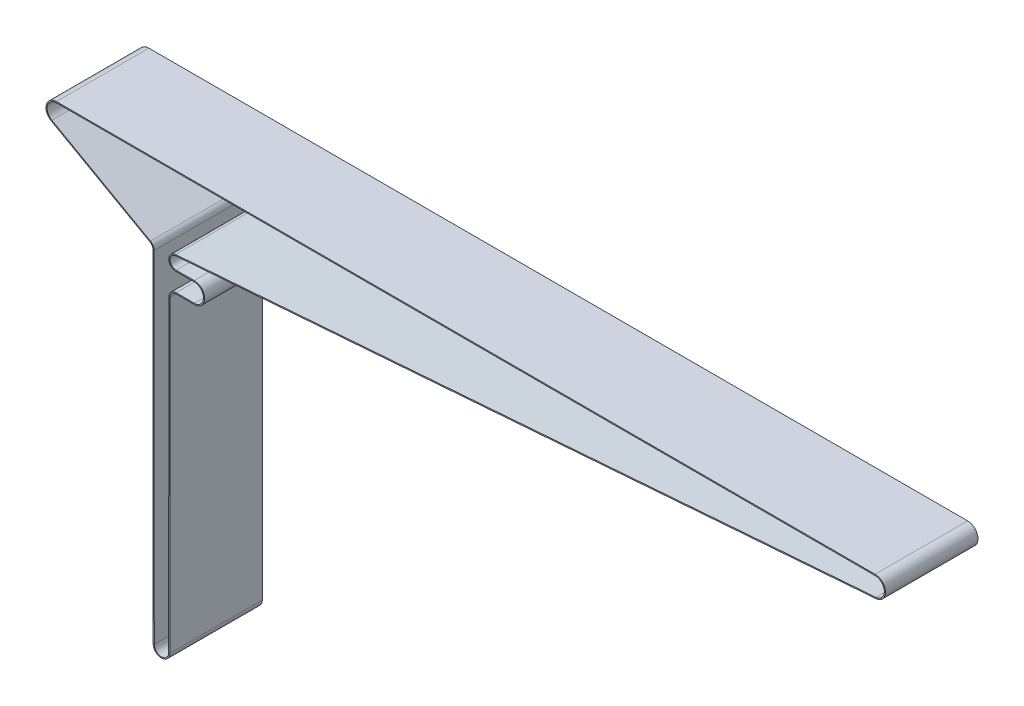
ISO-10303-21;
HEADER;
FILE_DESCRIPTION(('STEP AP214'),'2;1');
FILE_NAME('part.step','',(''),(''),'','','');
FILE_SCHEMA(('AUTOMOTIVE_DESIGN { 1 0 10303 214 1 1 1 1 }'));
ENDSEC;
DATA;
#1=APPLICATION_CONTEXT('core data for automotive mechanical design processes');
#2=APPLICATION_PROTOCOL_DEFINITION('international standard','automotive_design',2000,#1);
#3=PRODUCT_CONTEXT('',#1,'mechanical');
#4=PRODUCT('Part','Part','',(#3));
#5=PRODUCT_RELATED_PRODUCT_CATEGORY('part','',(#4));
#6=PRODUCT_DEFINITION_FORMATION('','',#4);
#7=PRODUCT_DEFINITION_CONTEXT('part definition',#1,'design');
#8=PRODUCT_DEFINITION('design','',#6,#7);
#9=PRODUCT_DEFINITION_SHAPE('','',#8);
#10=(LENGTH_UNIT() NAMED_UNIT(*) SI_UNIT(.MILLI.,.METRE.));
#11=(NAMED_UNIT(*) PLANE_ANGLE_UNIT() SI_UNIT($,.RADIAN.));
#12=(NAMED_UNIT(*) SI_UNIT($,.STERADIAN.) SOLID_ANGLE_UNIT());
#13=UNCERTAINTY_MEASURE_WITH_UNIT(LENGTH_MEASURE(1.E-05),#10,'distance_accuracy_value','');
#14=(GEOMETRIC_REPRESENTATION_CONTEXT(3) GLOBAL_UNCERTAINTY_ASSIGNED_CONTEXT((#13)) GLOBAL_UNIT_ASSIGNED_CONTEXT((#10,
#11,#12)) REPRESENTATION_CONTEXT('',''));
#15=CARTESIAN_POINT('',(0.,0.,0.));
#16=DIRECTION('',(0.,0.,1.));
#17=DIRECTION('',(1.,0.,0.));
#18=AXIS2_PLACEMENT_3D('',#15,#16,#17);
#19=CARTESIAN_POINT('',(-1124.003,0.,63.5));
#20=DIRECTION('',(0.,0.,1.));
#21=DIRECTION('',(1.,0.,0.));
#22=AXIS2_PLACEMENT_3D('',#19,#20,#21);
#23=PLANE('',#22);
#24=CARTESIAN_POINT('',(-1124.003,0.,63.5));
#25=DIRECTION('',(0.,0.,1.));
#26=DIRECTION('',(1.,0.,0.));
#27=AXIS2_PLACEMENT_3D('',#24,#25,#26);
#28=CIRCLE('',#27,14.2239999999999);
#29=CARTESIAN_POINT('',(-1124.003,14.2239999999999,63.5));
#30=VERTEX_POINT('',#29);
#31=CARTESIAN_POINT('',(-1130.96563725529,-12.403380928246,63.5));
#32=VERTEX_POINT('',#31);
#33=EDGE_CURVE('E517',#30,#32,#28,.T.);
#34=ORIENTED_EDGE('',*,*,#33,.T.);
#35=DIRECTION('',(0.872003721052174,-0.489499244607347,0.));
#36=VECTOR('',#35,1.);
#37=CARTESIAN_POINT('',(-1130.96563725529,-12.403380928246,63.5));
#38=LINE('',#37,#36);
#39=CARTESIAN_POINT('',(-995.600017331701,-88.3908648101406,63.5));
#40=VERTEX_POINT('',#39);
#41=EDGE_CURVE('E521',#32,#40,#38,.T.);
#42=ORIENTED_EDGE('',*,*,#41,.T.);
#43=CARTESIAN_POINT('',(-999.703,-95.7,63.5));
#44=DIRECTION('',(0.,0.,1.));
#45=DIRECTION('',(1.,0.,0.));
#46=AXIS2_PLACEMENT_3D('',#43,#44,#45);
#47=CIRCLE('',#46,8.3820000000001);
#48=CARTESIAN_POINT('',(-991.321000675714,-95.696634338988,63.5));
#49=VERTEX_POINT('',#48);
#50=EDGE_CURVE('E525',#49,#40,#47,.T.);
#51=ORIENTED_EDGE('',*,*,#50,.F.);
#52=DIRECTION('',(-0.000401534360747311,0.999999919385075,0.));
#53=VECTOR('',#52,1.);
#54=CARTESIAN_POINT('',(-991.132999078571,-563.904589537743,63.5));
#55=LINE('',#54,#53);
#56=CARTESIAN_POINT('',(-991.132999078571,-563.904589537743,63.5));
#57=VERTEX_POINT('',#56);
#58=EDGE_CURVE('E529',#57,#49,#55,.T.);
#59=ORIENTED_EDGE('',*,*,#58,.F.);
#60=CARTESIAN_POINT('',(-979.703,-563.9,63.5));
#61=DIRECTION('',(0.,0.,1.));
#62=DIRECTION('',(1.,0.,0.));
#63=AXIS2_PLACEMENT_3D('',#60,#61,#62);
#64=CIRCLE('',#63,11.4299999999998);
#65=CARTESIAN_POINT('',(-968.273001127799,-563.905077545945,63.5));
#66=VERTEX_POINT('',#65);
#67=EDGE_CURVE('E533',#57,#66,#64,.T.);
#68=ORIENTED_EDGE('',*,*,#67,.T.);
#69=DIRECTION('',(-0.000444229741491754,-0.999999901329964,0.));
#70=VECTOR('',#69,1.);
#71=CARTESIAN_POINT('',(-968.084999172948,-140.696276466307,63.5));
#72=LINE('',#71,#70);
#73=CARTESIAN_POINT('',(-968.084999172948,-140.696276466307,63.5));
#74=VERTEX_POINT('',#73);
#75=EDGE_CURVE('E536',#74,#66,#72,.T.);
#76=ORIENTED_EDGE('',*,*,#75,.F.);
#77=CARTESIAN_POINT('',(-959.703,-140.7,63.5));
#78=DIRECTION('',(0.,0.,1.));
#79=DIRECTION('',(1.,0.,0.));
#80=AXIS2_PLACEMENT_3D('',#77,#78,#79);
#81=CIRCLE('',#80,8.382);
#82=CARTESIAN_POINT('',(-959.66739224998,-132.318075633356,63.5));
#83=VERTEX_POINT('',#82);
#84=EDGE_CURVE('E540',#83,#74,#81,.T.);
#85=ORIENTED_EDGE('',*,*,#84,.F.);
#86=DIRECTION('',(-0.999990976693377,0.00424812097595381,0.));
#87=VECTOR('',#86,1.);
#88=CARTESIAN_POINT('',(-934.763425272762,-132.423871652486,63.5));
#89=LINE('',#88,#87);
#90=CARTESIAN_POINT('',(-934.763425272762,-132.423871652486,63.5));
#91=VERTEX_POINT('',#90);
#92=EDGE_CURVE('E543',#91,#83,#89,.T.);
#93=ORIENTED_EDGE('',*,*,#92,.F.);
#94=CARTESIAN_POINT('',(-934.703,-118.2,63.5));
#95=DIRECTION('',(0.,0.,1.));
#96=DIRECTION('',(1.,0.,0.));
#97=AXIS2_PLACEMENT_3D('',#94,#95,#96);
#98=CIRCLE('',#97,14.224);
#99=CARTESIAN_POINT('',(-934.763425272762,-103.976128347513,63.5));
#100=VERTEX_POINT('',#99);
#101=EDGE_CURVE('E547',#100,#91,#98,.F.);
#102=ORIENTED_EDGE('',*,*,#101,.F.);
#103=DIRECTION('',(0.999990976693377,0.00424812097596445,0.));
#104=VECTOR('',#103,1.);
#105=CARTESIAN_POINT('',(-959.66739224998,-104.081924366644,63.5));
#106=LINE('',#105,#104);
#107=CARTESIAN_POINT('',(-959.66739224998,-104.081924366644,63.5));
#108=VERTEX_POINT('',#107);
#109=EDGE_CURVE('E551',#108,#100,#106,.T.);
#110=ORIENTED_EDGE('',*,*,#109,.F.);
#111=CARTESIAN_POINT('',(-959.703,-95.7,63.5));
#112=DIRECTION('',(0.,0.,1.));
#113=DIRECTION('',(1.,0.,0.));
#114=AXIS2_PLACEMENT_3D('',#111,#112,#113);
#115=CIRCLE('',#114,8.382);
#116=CARTESIAN_POINT('',(-960.338990006156,-87.3421629166351,63.5));
#117=VERTEX_POINT('',#116);
#118=EDGE_CURVE('E555',#108,#117,#115,.F.);
#119=ORIENTED_EDGE('',*,*,#118,.T.);
#120=DIRECTION('',(0.997117285059044,0.0758756867282383,0.));
#121=VECTOR('',#120,1.);
#122=CARTESIAN_POINT('',(-960.338990006156,-87.3421629166351,63.5));
#123=LINE('',#122,#121);
#124=CARTESIAN_POINT('',(1.07925576802259,-14.1829962626798,63.5));
#125=VERTEX_POINT('',#124);
#126=EDGE_CURVE('E558',#117,#125,#123,.T.);
#127=ORIENTED_EDGE('',*,*,#126,.T.);
#128=CARTESIAN_POINT('',(0.,0.,63.5));
#129=DIRECTION('',(0.,0.,1.));
#130=DIRECTION('',(1.,0.,0.));
#131=AXIS2_PLACEMENT_3D('',#128,#129,#130);
#132=CIRCLE('',#131,14.224);
#133=CARTESIAN_POINT('',(-4.44089209850063E-13,14.224,63.5));
#134=VERTEX_POINT('',#133);
#135=EDGE_CURVE('E561',#125,#134,#132,.T.);
#136=ORIENTED_EDGE('',*,*,#135,.T.);
#137=DIRECTION('',(1.,0.,0.));
#138=VECTOR('',#137,1.);
#139=CARTESIAN_POINT('',(-1124.003,14.224,63.5));
#140=LINE('',#139,#138);
#141=EDGE_CURVE('E564',#30,#134,#140,.T.);
#142=ORIENTED_EDGE('',*,*,#141,.F.);
#143=EDGE_LOOP('',(#34,#42,#51,#59,#68,#76,#85,#93,#102,#110,#119,#127,#136,#142));
#144=FACE_BOUND('',#143,.T.);
#145=DIRECTION('',(0.872003721052174,-0.489499244607347,0.));
#146=VECTOR('',#145,1.);
#147=CARTESIAN_POINT('',(-1130.21964040651,-11.0744472573625,63.5));
#148=LINE('',#147,#146);
#149=CARTESIAN_POINT('',(-1130.21964040651,-11.0744472573625,63.5));
#150=VERTEX_POINT('',#149);
#151=CARTESIAN_POINT('',(-994.85402048292,-87.0619311392571,63.5));
#152=VERTEX_POINT('',#151);
#153=EDGE_CURVE('E370',#150,#152,#148,.T.);
#154=ORIENTED_EDGE('',*,*,#153,.F.);
#155=CARTESIAN_POINT('',(-1124.003,0.,63.5));
#156=DIRECTION('',(0.,0.,1.));
#157=DIRECTION('',(1.,0.,0.));
#158=AXIS2_PLACEMENT_3D('',#155,#156,#157);
#159=CIRCLE('',#158,12.6999999999999);
#160=CARTESIAN_POINT('',(-1124.003,12.7,63.5));
#161=VERTEX_POINT('',#160);
#162=EDGE_CURVE('E361',#161,#150,#159,.T.);
#163=ORIENTED_EDGE('',*,*,#162,.F.);
#164=DIRECTION('',(1.,0.,0.));
#165=VECTOR('',#164,1.);
#166=CARTESIAN_POINT('',(-1124.003,12.7,63.5));
#167=LINE('',#166,#165);
#168=CARTESIAN_POINT('',(0.,12.7,63.5));
#169=VERTEX_POINT('',#168);
#170=EDGE_CURVE('E428',#161,#169,#167,.T.);
#171=ORIENTED_EDGE('',*,*,#170,.T.);
#172=CARTESIAN_POINT('',(0.,0.,63.5));
#173=DIRECTION('',(0.,0.,1.));
#174=DIRECTION('',(1.,0.,0.));
#175=AXIS2_PLACEMENT_3D('',#172,#173,#174);
#176=CIRCLE('',#175,12.7);
#177=CARTESIAN_POINT('',(0.963621221448618,-12.6633895202498,63.5));
#178=VERTEX_POINT('',#177);
#179=EDGE_CURVE('E425',#178,#169,#176,.T.);
#180=ORIENTED_EDGE('',*,*,#179,.F.);
#181=DIRECTION('',(0.997117285059044,0.0758756867282383,0.));
#182=VECTOR('',#181,1.);
#183=CARTESIAN_POINT('',(-960.45462455273,-85.8225561742051,63.5));
#184=LINE('',#183,#182);
#185=CARTESIAN_POINT('',(-960.45462455273,-85.8225561742051,63.5));
#186=VERTEX_POINT('',#185);
#187=EDGE_CURVE('E422',#186,#178,#184,.T.);
#188=ORIENTED_EDGE('',*,*,#187,.F.);
#189=CARTESIAN_POINT('',(-959.703,-95.7,63.5));
#190=DIRECTION('',(0.,0.,-1.));
#191=DIRECTION('',(-1.,0.,0.));
#192=AXIS2_PLACEMENT_3D('',#189,#190,#191);
#193=CIRCLE('',#192,9.906);
#194=CARTESIAN_POINT('',(-959.660918113612,-105.605910615125,63.5));
#195=VERTEX_POINT('',#194);
#196=EDGE_CURVE('E419',#195,#186,#193,.T.);
#197=ORIENTED_EDGE('',*,*,#196,.F.);
#198=DIRECTION('',(0.999990976693377,0.00424812097596445,0.));
#199=VECTOR('',#198,1.);
#200=CARTESIAN_POINT('',(-959.660918113612,-105.605910615125,63.5));
#201=LINE('',#200,#199);
#202=CARTESIAN_POINT('',(-934.756951136395,-105.500114595994,63.5));
#203=VERTEX_POINT('',#202);
#204=EDGE_CURVE('E415',#195,#203,#201,.T.);
#205=ORIENTED_EDGE('',*,*,#204,.T.);
#206=CARTESIAN_POINT('',(-934.703,-118.2,63.5));
#207=DIRECTION('',(0.,0.,-1.));
#208=DIRECTION('',(-1.,0.,0.));
#209=AXIS2_PLACEMENT_3D('',#206,#207,#208);
#210=CIRCLE('',#209,12.7);
#211=CARTESIAN_POINT('',(-934.756951136395,-130.899885404006,63.5));
#212=VERTEX_POINT('',#211);
#213=EDGE_CURVE('E411',#203,#212,#210,.T.);
#214=ORIENTED_EDGE('',*,*,#213,.T.);
#215=DIRECTION('',(-0.999990976693377,0.00424812097595381,0.));
#216=VECTOR('',#215,1.);
#217=CARTESIAN_POINT('',(-934.756951136395,-130.899885404006,63.5));
#218=LINE('',#217,#216);
#219=CARTESIAN_POINT('',(-959.660918113612,-130.794089384875,63.5));
#220=VERTEX_POINT('',#219);
#221=EDGE_CURVE('E407',#212,#220,#218,.T.);
#222=ORIENTED_EDGE('',*,*,#221,.T.);
#223=CARTESIAN_POINT('',(-959.703,-140.7,63.5));
#224=DIRECTION('',(0.,0.,1.));
#225=DIRECTION('',(1.,0.,0.));
#226=AXIS2_PLACEMENT_3D('',#223,#224,#225);
#227=CIRCLE('',#226,9.906);
#228=CARTESIAN_POINT('',(-969.608999022575,-140.695599460181,63.5));
#229=VERTEX_POINT('',#228);
#230=EDGE_CURVE('E404',#220,#229,#227,.T.);
#231=ORIENTED_EDGE('',*,*,#230,.T.);
#232=DIRECTION('',(-0.000444229741491754,-0.999999901329964,0.));
#233=VECTOR('',#232,1.);
#234=CARTESIAN_POINT('',(-969.608999022575,-140.695599460181,63.5));
#235=LINE('',#234,#233);
#236=CARTESIAN_POINT('',(-969.797000977425,-563.904400539819,63.5));
#237=VERTEX_POINT('',#236);
#238=EDGE_CURVE('E400',#229,#237,#235,.T.);
#239=ORIENTED_EDGE('',*,*,#238,.T.);
#240=CARTESIAN_POINT('',(-979.703,-563.9,63.5));
#241=DIRECTION('',(0.,0.,1.));
#242=DIRECTION('',(1.,0.,0.));
#243=AXIS2_PLACEMENT_3D('',#240,#241,#242);
#244=CIRCLE('',#243,9.90599999999976);
#245=CARTESIAN_POINT('',(-989.608999201428,-563.903977599378,63.5));
#246=VERTEX_POINT('',#245);
#247=EDGE_CURVE('E397',#246,#237,#244,.T.);
#248=ORIENTED_EDGE('',*,*,#247,.F.);
#249=DIRECTION('',(-0.000401534360747311,0.999999919385075,0.));
#250=VECTOR('',#249,1.);
#251=CARTESIAN_POINT('',(-989.608999201428,-563.903977599378,63.5));
#252=LINE('',#251,#250);
#253=CARTESIAN_POINT('',(-989.797000798572,-95.6960224006224,63.5));
#254=VERTEX_POINT('',#253);
#255=EDGE_CURVE('E392',#246,#254,#252,.T.);
#256=ORIENTED_EDGE('',*,*,#255,.T.);
#257=CARTESIAN_POINT('',(-999.703,-95.7,63.5));
#258=DIRECTION('',(0.,0.,1.));
#259=DIRECTION('',(1.,0.,0.));
#260=AXIS2_PLACEMENT_3D('',#257,#258,#259);
#261=CIRCLE('',#260,9.9060000000001);
#262=EDGE_CURVE('E385',#254,#152,#261,.T.);
#263=ORIENTED_EDGE('',*,*,#262,.T.);
#264=EDGE_LOOP('',(#154,#163,#171,#180,#188,#197,#205,#214,#222,#231,#239,#248,#256,#263));
#265=FACE_BOUND('',#264,.T.);
#266=ADVANCED_FACE('F129',(#144,#265),#23,.T.);
#267=CARTESIAN_POINT('',(-1124.003,0.,-63.5));
#268=DIRECTION('',(0.,0.,1.));
#269=DIRECTION('',(1.,0.,0.));
#270=AXIS2_PLACEMENT_3D('',#267,#268,#269);
#271=PLANE('',#270);
#272=CARTESIAN_POINT('',(-1124.003,0.,-63.5));
#273=DIRECTION('',(0.,0.,1.));
#274=DIRECTION('',(1.,0.,0.));
#275=AXIS2_PLACEMENT_3D('',#272,#273,#274);
#276=CIRCLE('',#275,14.2239999999999);
#277=CARTESIAN_POINT('',(-1124.003,14.2239999999999,-63.5));
#278=VERTEX_POINT('',#277);
#279=CARTESIAN_POINT('',(-1130.96563725529,-12.403380928246,-63.5));
#280=VERTEX_POINT('',#279);
#281=EDGE_CURVE('E379',#278,#280,#276,.T.);
#282=ORIENTED_EDGE('',*,*,#281,.F.);
#283=DIRECTION('',(1.,0.,0.));
#284=VECTOR('',#283,1.);
#285=CARTESIAN_POINT('',(-1124.003,14.224,-63.5));
#286=LINE('',#285,#284);
#287=CARTESIAN_POINT('',(-4.44089209850063E-13,14.224,-63.5));
#288=VERTEX_POINT('',#287);
#289=EDGE_CURVE('E522',#278,#288,#286,.T.);
#290=ORIENTED_EDGE('',*,*,#289,.T.);
#291=CARTESIAN_POINT('',(0.,0.,-63.5));
#292=DIRECTION('',(0.,0.,1.));
#293=DIRECTION('',(1.,0.,0.));
#294=AXIS2_PLACEMENT_3D('',#291,#292,#293);
#295=CIRCLE('',#294,14.224);
#296=CARTESIAN_POINT('',(1.07925576802259,-14.1829962626798,-63.5));
#297=VERTEX_POINT('',#296);
#298=EDGE_CURVE('E614',#297,#288,#295,.T.);
#299=ORIENTED_EDGE('',*,*,#298,.F.);
#300=DIRECTION('',(0.997117285059044,0.0758756867282383,0.));
#301=VECTOR('',#300,1.);
#302=CARTESIAN_POINT('',(-960.338990006156,-87.3421629166351,-63.5));
#303=LINE('',#302,#301);
#304=CARTESIAN_POINT('',(-960.338990006156,-87.3421629166351,-63.5));
#305=VERTEX_POINT('',#304);
#306=EDGE_CURVE('E611',#305,#297,#303,.T.);
#307=ORIENTED_EDGE('',*,*,#306,.F.);
#308=CARTESIAN_POINT('',(-959.703,-95.7,-63.5));
#309=DIRECTION('',(0.,0.,1.));
#310=DIRECTION('',(1.,0.,0.));
#311=AXIS2_PLACEMENT_3D('',#308,#309,#310);
#312=CIRCLE('',#311,8.382);
#313=CARTESIAN_POINT('',(-959.66739224998,-104.081924366644,-63.5));
#314=VERTEX_POINT('',#313);
#315=EDGE_CURVE('E608',#314,#305,#312,.F.);
#316=ORIENTED_EDGE('',*,*,#315,.F.);
#317=DIRECTION('',(0.999990976693377,0.00424812097596445,0.));
#318=VECTOR('',#317,1.);
#319=CARTESIAN_POINT('',(-959.66739224998,-104.081924366644,-63.5));
#320=LINE('',#319,#318);
#321=CARTESIAN_POINT('',(-934.763425272762,-103.976128347513,-63.5));
#322=VERTEX_POINT('',#321);
#323=EDGE_CURVE('E604',#314,#322,#320,.T.);
#324=ORIENTED_EDGE('',*,*,#323,.T.);
#325=CARTESIAN_POINT('',(-934.703,-118.2,-63.5));
#326=DIRECTION('',(0.,0.,1.));
#327=DIRECTION('',(1.,0.,0.));
#328=AXIS2_PLACEMENT_3D('',#325,#326,#327);
#329=CIRCLE('',#328,14.224);
#330=CARTESIAN_POINT('',(-934.763425272762,-132.423871652486,-63.5));
#331=VERTEX_POINT('',#330);
#332=EDGE_CURVE('E600',#322,#331,#329,.F.);
#333=ORIENTED_EDGE('',*,*,#332,.T.);
#334=DIRECTION('',(-0.999990976693377,0.00424812097595381,0.));
#335=VECTOR('',#334,1.);
#336=CARTESIAN_POINT('',(-934.763425272762,-132.423871652486,-63.5));
#337=LINE('',#336,#335);
#338=CARTESIAN_POINT('',(-959.66739224998,-132.318075633356,-63.5));
#339=VERTEX_POINT('',#338);
#340=EDGE_CURVE('E596',#331,#339,#337,.T.);
#341=ORIENTED_EDGE('',*,*,#340,.T.);
#342=CARTESIAN_POINT('',(-959.703,-140.7,-63.5));
#343=DIRECTION('',(0.,0.,1.));
#344=DIRECTION('',(1.,0.,0.));
#345=AXIS2_PLACEMENT_3D('',#342,#343,#344);
#346=CIRCLE('',#345,8.382);
#347=CARTESIAN_POINT('',(-968.084999172948,-140.696276466307,-63.5));
#348=VERTEX_POINT('',#347);
#349=EDGE_CURVE('E592',#339,#348,#346,.T.);
#350=ORIENTED_EDGE('',*,*,#349,.T.);
#351=DIRECTION('',(-0.000444229741491754,-0.999999901329964,0.));
#352=VECTOR('',#351,1.);
#353=CARTESIAN_POINT('',(-968.084999172948,-140.696276466307,-63.5));
#354=LINE('',#353,#352);
#355=CARTESIAN_POINT('',(-968.273001127799,-563.905077545945,-63.5));
#356=VERTEX_POINT('',#355);
#357=EDGE_CURVE('E588',#348,#356,#354,.T.);
#358=ORIENTED_EDGE('',*,*,#357,.T.);
#359=CARTESIAN_POINT('',(-979.703,-563.9,-63.5));
#360=DIRECTION('',(0.,0.,1.));
#361=DIRECTION('',(1.,0.,0.));
#362=AXIS2_PLACEMENT_3D('',#359,#360,#361);
#363=CIRCLE('',#362,11.4299999999998);
#364=CARTESIAN_POINT('',(-991.132999078571,-563.904589537743,-63.5));
#365=VERTEX_POINT('',#364);
#366=EDGE_CURVE('E584',#365,#356,#363,.T.);
#367=ORIENTED_EDGE('',*,*,#366,.F.);
#368=DIRECTION('',(-0.000401534360747311,0.999999919385075,0.));
#369=VECTOR('',#368,1.);
#370=CARTESIAN_POINT('',(-991.132999078571,-563.904589537743,-63.5));
#371=LINE('',#370,#369);
#372=CARTESIAN_POINT('',(-991.321000675714,-95.696634338988,-63.5));
#373=VERTEX_POINT('',#372);
#374=EDGE_CURVE('E580',#365,#373,#371,.T.);
#375=ORIENTED_EDGE('',*,*,#374,.T.);
#376=CARTESIAN_POINT('',(-999.703,-95.7,-63.5));
#377=DIRECTION('',(0.,0.,1.));
#378=DIRECTION('',(1.,0.,0.));
#379=AXIS2_PLACEMENT_3D('',#376,#377,#378);
#380=CIRCLE('',#379,8.3820000000001);
#381=CARTESIAN_POINT('',(-995.600017331701,-88.3908648101406,-63.5));
#382=VERTEX_POINT('',#381);
#383=EDGE_CURVE('E576',#373,#382,#380,.T.);
#384=ORIENTED_EDGE('',*,*,#383,.T.);
#385=DIRECTION('',(0.872003721052174,-0.489499244607347,0.));
#386=VECTOR('',#385,1.);
#387=CARTESIAN_POINT('',(-1130.96563725529,-12.403380928246,-63.5));
#388=LINE('',#387,#386);
#389=EDGE_CURVE('E572',#280,#382,#388,.T.);
#390=ORIENTED_EDGE('',*,*,#389,.F.);
#391=EDGE_LOOP('',(#282,#290,#299,#307,#316,#324,#333,#341,#350,#358,#367,#375,#384,#390));
#392=FACE_BOUND('',#391,.T.);
#393=CARTESIAN_POINT('',(-1124.003,0.,-63.5));
#394=DIRECTION('',(0.,0.,1.));
#395=DIRECTION('',(1.,0.,0.));
#396=AXIS2_PLACEMENT_3D('',#393,#394,#395);
#397=CIRCLE('',#396,12.6999999999999);
#398=CARTESIAN_POINT('',(-1124.003,12.7,-63.5));
#399=VERTEX_POINT('',#398);
#400=CARTESIAN_POINT('',(-1130.21964040651,-11.0744472573625,-63.5));
#401=VERTEX_POINT('',#400);
#402=EDGE_CURVE('E156',#399,#401,#397,.T.);
#403=ORIENTED_EDGE('',*,*,#402,.T.);
#404=DIRECTION('',(0.872003721052174,-0.489499244607347,0.));
#405=VECTOR('',#404,1.);
#406=CARTESIAN_POINT('',(-1130.21964040651,-11.0744472573625,-63.5));
#407=LINE('',#406,#405);
#408=CARTESIAN_POINT('',(-994.85402048292,-87.0619311392571,-63.5));
#409=VERTEX_POINT('',#408);
#410=EDGE_CURVE('E377',#401,#409,#407,.T.);
#411=ORIENTED_EDGE('',*,*,#410,.T.);
#412=CARTESIAN_POINT('',(-999.703,-95.7,-63.5));
#413=DIRECTION('',(0.,0.,1.));
#414=DIRECTION('',(1.,0.,0.));
#415=AXIS2_PLACEMENT_3D('',#412,#413,#414);
#416=CIRCLE('',#415,9.9060000000001);
#417=CARTESIAN_POINT('',(-989.797000798572,-95.6960224006224,-63.5));
#418=VERTEX_POINT('',#417);
#419=EDGE_CURVE('E435',#418,#409,#416,.T.);
#420=ORIENTED_EDGE('',*,*,#419,.F.);
#421=DIRECTION('',(-0.000401534360747311,0.999999919385075,0.));
#422=VECTOR('',#421,1.);
#423=CARTESIAN_POINT('',(-989.608999201428,-563.903977599378,-63.5));
#424=LINE('',#423,#422);
#425=CARTESIAN_POINT('',(-989.608999201428,-563.903977599378,-63.5));
#426=VERTEX_POINT('',#425);
#427=EDGE_CURVE('E439',#426,#418,#424,.T.);
#428=ORIENTED_EDGE('',*,*,#427,.F.);
#429=CARTESIAN_POINT('',(-979.703,-563.9,-63.5));
#430=DIRECTION('',(0.,0.,1.));
#431=DIRECTION('',(1.,0.,0.));
#432=AXIS2_PLACEMENT_3D('',#429,#430,#431);
#433=CIRCLE('',#432,9.90599999999976);
#434=CARTESIAN_POINT('',(-969.797000977425,-563.904400539819,-63.5));
#435=VERTEX_POINT('',#434);
#436=EDGE_CURVE('E443',#426,#435,#433,.T.);
#437=ORIENTED_EDGE('',*,*,#436,.T.);
#438=DIRECTION('',(-0.000444229741491754,-0.999999901329964,0.));
#439=VECTOR('',#438,1.);
#440=CARTESIAN_POINT('',(-969.608999022575,-140.695599460181,-63.5));
#441=LINE('',#440,#439);
#442=CARTESIAN_POINT('',(-969.608999022575,-140.695599460181,-63.5));
#443=VERTEX_POINT('',#442);
#444=EDGE_CURVE('E447',#443,#435,#441,.T.);
#445=ORIENTED_EDGE('',*,*,#444,.F.);
#446=CARTESIAN_POINT('',(-959.703,-140.7,-63.5));
#447=DIRECTION('',(0.,0.,1.));
#448=DIRECTION('',(1.,0.,0.));
#449=AXIS2_PLACEMENT_3D('',#446,#447,#448);
#450=CIRCLE('',#449,9.906);
#451=CARTESIAN_POINT('',(-959.660918113612,-130.794089384875,-63.5));
#452=VERTEX_POINT('',#451);
#453=EDGE_CURVE('E451',#452,#443,#450,.T.);
#454=ORIENTED_EDGE('',*,*,#453,.F.);
#455=DIRECTION('',(-0.999990976693377,0.00424812097595381,0.));
#456=VECTOR('',#455,1.);
#457=CARTESIAN_POINT('',(-934.756951136395,-130.899885404006,-63.5));
#458=LINE('',#457,#456);
#459=CARTESIAN_POINT('',(-934.756951136395,-130.899885404006,-63.5));
#460=VERTEX_POINT('',#459);
#461=EDGE_CURVE('E455',#460,#452,#458,.T.);
#462=ORIENTED_EDGE('',*,*,#461,.F.);
#463=CARTESIAN_POINT('',(-934.703,-118.2,-63.5));
#464=DIRECTION('',(0.,0.,-1.));
#465=DIRECTION('',(-1.,0.,0.));
#466=AXIS2_PLACEMENT_3D('',#463,#464,#465);
#467=CIRCLE('',#466,12.7);
#468=CARTESIAN_POINT('',(-934.756951136395,-105.500114595994,-63.5));
#469=VERTEX_POINT('',#468);
#470=EDGE_CURVE('E459',#469,#460,#467,.T.);
#471=ORIENTED_EDGE('',*,*,#470,.F.);
#472=DIRECTION('',(0.999990976693377,0.00424812097596445,0.));
#473=VECTOR('',#472,1.);
#474=CARTESIAN_POINT('',(-959.660918113612,-105.605910615125,-63.5));
#475=LINE('',#474,#473);
#476=CARTESIAN_POINT('',(-959.660918113612,-105.605910615125,-63.5));
#477=VERTEX_POINT('',#476);
#478=EDGE_CURVE('E463',#477,#469,#475,.T.);
#479=ORIENTED_EDGE('',*,*,#478,.F.);
#480=CARTESIAN_POINT('',(-959.703,-95.7,-63.5));
#481=DIRECTION('',(0.,0.,-1.));
#482=DIRECTION('',(-1.,0.,0.));
#483=AXIS2_PLACEMENT_3D('',#480,#481,#482);
#484=CIRCLE('',#483,9.906);
#485=CARTESIAN_POINT('',(-960.45462455273,-85.8225561742051,-63.5));
#486=VERTEX_POINT('',#485);
#487=EDGE_CURVE('E467',#477,#486,#484,.T.);
#488=ORIENTED_EDGE('',*,*,#487,.T.);
#489=DIRECTION('',(0.997117285059044,0.0758756867282383,0.));
#490=VECTOR('',#489,1.);
#491=CARTESIAN_POINT('',(-960.45462455273,-85.8225561742051,-63.5));
#492=LINE('',#491,#490);
#493=CARTESIAN_POINT('',(0.963621221448618,-12.6633895202498,-63.5));
#494=VERTEX_POINT('',#493);
#495=EDGE_CURVE('E471',#486,#494,#492,.T.);
#496=ORIENTED_EDGE('',*,*,#495,.T.);
#497=CARTESIAN_POINT('',(0.,0.,-63.5));
#498=DIRECTION('',(0.,0.,1.));
#499=DIRECTION('',(1.,0.,0.));
#500=AXIS2_PLACEMENT_3D('',#497,#498,#499);
#501=CIRCLE('',#500,12.7);
#502=CARTESIAN_POINT('',(0.,12.7,-63.5));
#503=VERTEX_POINT('',#502);
#504=EDGE_CURVE('E475',#494,#503,#501,.T.);
#505=ORIENTED_EDGE('',*,*,#504,.T.);
#506=DIRECTION('',(1.,0.,0.));
#507=VECTOR('',#506,1.);
#508=CARTESIAN_POINT('',(-1124.003,12.7,-63.5));
#509=LINE('',#508,#507);
#510=EDGE_CURVE('E371',#399,#503,#509,.T.);
#511=ORIENTED_EDGE('',*,*,#510,.F.);
#512=EDGE_LOOP('',(#403,#411,#420,#428,#437,#445,#454,#462,#471,#479,#488,#496,#505,#511));
#513=FACE_BOUND('',#512,.T.);
#514=ADVANCED_FACE('F671',(#392,#513),#271,.F.);
#515=CARTESIAN_POINT('',(-1124.003,0.,63.5));
#516=DIRECTION('',(0.,0.,-1.));
#517=DIRECTION('',(-1.,0.,0.));
#518=AXIS2_PLACEMENT_3D('',#515,#516,#517);
#519=CYLINDRICAL_SURFACE('',#518,14.2239999999999);
#520=ORIENTED_EDGE('',*,*,#281,.T.);
#521=DIRECTION('',(0.,0.,-1.));
#522=VECTOR('',#521,1.);
#523=CARTESIAN_POINT('',(-1130.96563725529,-12.403380928246,63.5));
#524=LINE('',#523,#522);
#525=EDGE_CURVE('E12',#32,#280,#524,.T.);
#526=ORIENTED_EDGE('',*,*,#525,.F.);
#527=ORIENTED_EDGE('',*,*,#33,.F.);
#528=DIRECTION('',(0.,0.,-1.));
#529=VECTOR('',#528,1.);
#530=CARTESIAN_POINT('',(-1124.003,14.2239999999999,63.5));
#531=LINE('',#530,#529);
#532=EDGE_CURVE('E568',#30,#278,#531,.T.);
#533=ORIENTED_EDGE('',*,*,#532,.T.);
#534=EDGE_LOOP('',(#520,#526,#527,#533));
#535=FACE_BOUND('',#534,.T.);
#536=ADVANCED_FACE('F131',(#535),#519,.T.);
#537=CARTESIAN_POINT('',(-1130.96563725529,-12.403380928246,63.5));
#538=DIRECTION('',(0.489499244607347,0.872003721052174,0.));
#539=DIRECTION('',(-0.872003721052174,0.489499244607347,0.));
#540=AXIS2_PLACEMENT_3D('',#537,#538,#539);
#541=PLANE('',#540);
#542=ORIENTED_EDGE('',*,*,#389,.T.);
#543=DIRECTION('',(0.,0.,-1.));
#544=VECTOR('',#543,1.);
#545=CARTESIAN_POINT('',(-995.600017331701,-88.3908648101406,63.5));
#546=LINE('',#545,#544);
#547=EDGE_CURVE('E138',#40,#382,#546,.T.);
#548=ORIENTED_EDGE('',*,*,#547,.F.);
#549=ORIENTED_EDGE('',*,*,#41,.F.);
#550=ORIENTED_EDGE('',*,*,#525,.T.);
#551=EDGE_LOOP('',(#542,#548,#549,#550));
#552=FACE_BOUND('',#551,.T.);
#553=ADVANCED_FACE('F667',(#552),#541,.F.);
#554=CARTESIAN_POINT('',(-999.703,-95.7,63.5));
#555=DIRECTION('',(0.,0.,-1.));
#556=DIRECTION('',(-1.,0.,0.));
#557=AXIS2_PLACEMENT_3D('',#554,#555,#556);
#558=CYLINDRICAL_SURFACE('',#557,8.3820000000001);
#559=ORIENTED_EDGE('',*,*,#383,.F.);
#560=DIRECTION('',(0.,0.,-1.));
#561=VECTOR('',#560,1.);
#562=CARTESIAN_POINT('',(-991.321000675714,-95.696634338988,63.5));
#563=LINE('',#562,#561);
#564=EDGE_CURVE('E655',#49,#373,#563,.T.);
#565=ORIENTED_EDGE('',*,*,#564,.F.);
#566=ORIENTED_EDGE('',*,*,#50,.T.);
#567=ORIENTED_EDGE('',*,*,#547,.T.);
#568=EDGE_LOOP('',(#559,#565,#566,#567));
#569=FACE_BOUND('',#568,.T.);
#570=ADVANCED_FACE('F664',(#569),#558,.F.);
#571=CARTESIAN_POINT('',(-991.132999078571,-563.904589537743,63.5));
#572=DIRECTION('',(-0.999999919385075,-0.000401534360747311,0.));
#573=DIRECTION('',(0.000401534360747311,-0.999999919385075,0.));
#574=AXIS2_PLACEMENT_3D('',#571,#572,#573);
#575=PLANE('',#574);
#576=ORIENTED_EDGE('',*,*,#374,.F.);
#577=DIRECTION('',(0.,0.,-1.));
#578=VECTOR('',#577,1.);
#579=CARTESIAN_POINT('',(-991.132999078571,-563.904589537743,63.5));
#580=LINE('',#579,#578);
#581=EDGE_CURVE('E652',#57,#365,#580,.T.);
#582=ORIENTED_EDGE('',*,*,#581,.F.);
#583=ORIENTED_EDGE('',*,*,#58,.T.);
#584=ORIENTED_EDGE('',*,*,#564,.T.);
#585=EDGE_LOOP('',(#576,#582,#583,#584));
#586=FACE_BOUND('',#585,.T.);
#587=ADVANCED_FACE('F676',(#586),#575,.T.);
#588=CARTESIAN_POINT('',(-979.703,-563.9,63.5));
#589=DIRECTION('',(0.,0.,-1.));
#590=DIRECTION('',(-1.,0.,0.));
#591=AXIS2_PLACEMENT_3D('',#588,#589,#590);
#592=CYLINDRICAL_SURFACE('',#591,11.4299999999998);
#593=ORIENTED_EDGE('',*,*,#366,.T.);
#594=DIRECTION('',(0.,0.,-1.));
#595=VECTOR('',#594,1.);
#596=CARTESIAN_POINT('',(-968.273001127799,-563.905077545945,63.5));
#597=LINE('',#596,#595);
#598=EDGE_CURVE('E649',#66,#356,#597,.T.);
#599=ORIENTED_EDGE('',*,*,#598,.F.);
#600=ORIENTED_EDGE('',*,*,#67,.F.);
#601=ORIENTED_EDGE('',*,*,#581,.T.);
#602=EDGE_LOOP('',(#593,#599,#600,#601));
#603=FACE_BOUND('',#602,.T.);
#604=ADVANCED_FACE('F723',(#603),#592,.T.);
#605=CARTESIAN_POINT('',(-968.084999172948,-140.696276466307,63.5));
#606=DIRECTION('',(0.999999901329964,-0.000444229741491754,0.));
#607=DIRECTION('',(0.000444229741491754,0.999999901329964,0.));
#608=AXIS2_PLACEMENT_3D('',#605,#606,#607);
#609=PLANE('',#608);
#610=ORIENTED_EDGE('',*,*,#357,.F.);
#611=DIRECTION('',(0.,0.,-1.));
#612=VECTOR('',#611,1.);
#613=CARTESIAN_POINT('',(-968.084999172948,-140.696276466307,63.5));
#614=LINE('',#613,#612);
#615=EDGE_CURVE('E646',#74,#348,#614,.T.);
#616=ORIENTED_EDGE('',*,*,#615,.F.);
#617=ORIENTED_EDGE('',*,*,#75,.T.);
#618=ORIENTED_EDGE('',*,*,#598,.T.);
#619=EDGE_LOOP('',(#610,#616,#617,#618));
#620=FACE_BOUND('',#619,.T.);
#621=ADVANCED_FACE('F719',(#620),#609,.T.);
#622=CARTESIAN_POINT('',(-959.703,-140.7,63.5));
#623=DIRECTION('',(0.,0.,-1.));
#624=DIRECTION('',(-1.,0.,0.));
#625=AXIS2_PLACEMENT_3D('',#622,#623,#624);
#626=CYLINDRICAL_SURFACE('',#625,8.382);
#627=ORIENTED_EDGE('',*,*,#349,.F.);
#628=DIRECTION('',(0.,0.,-1.));
#629=VECTOR('',#628,1.);
#630=CARTESIAN_POINT('',(-959.66739224998,-132.318075633356,63.5));
#631=LINE('',#630,#629);
#632=EDGE_CURVE('E643',#83,#339,#631,.T.);
#633=ORIENTED_EDGE('',*,*,#632,.F.);
#634=ORIENTED_EDGE('',*,*,#84,.T.);
#635=ORIENTED_EDGE('',*,*,#615,.T.);
#636=EDGE_LOOP('',(#627,#633,#634,#635));
#637=FACE_BOUND('',#636,.T.);
#638=ADVANCED_FACE('F716',(#637),#626,.F.);
#639=CARTESIAN_POINT('',(-934.763425272762,-132.423871652486,63.5));
#640=DIRECTION('',(-0.00424812097595381,-0.999990976693377,0.));
#641=DIRECTION('',(0.999990976693377,-0.00424812097595381,0.));
#642=AXIS2_PLACEMENT_3D('',#639,#640,#641);
#643=PLANE('',#642);
#644=ORIENTED_EDGE('',*,*,#340,.F.);
#645=DIRECTION('',(0.,0.,-1.));
#646=VECTOR('',#645,1.);
#647=CARTESIAN_POINT('',(-934.763425272762,-132.423871652486,63.5));
#648=LINE('',#647,#646);
#649=EDGE_CURVE('E640',#91,#331,#648,.T.);
#650=ORIENTED_EDGE('',*,*,#649,.F.);
#651=ORIENTED_EDGE('',*,*,#92,.T.);
#652=ORIENTED_EDGE('',*,*,#632,.T.);
#653=EDGE_LOOP('',(#644,#650,#651,#652));
#654=FACE_BOUND('',#653,.T.);
#655=ADVANCED_FACE('F712',(#654),#643,.T.);
#656=CARTESIAN_POINT('',(-934.703,-118.2,63.5));
#657=DIRECTION('',(0.,0.,-1.));
#658=DIRECTION('',(-1.,0.,0.));
#659=AXIS2_PLACEMENT_3D('',#656,#657,#658);
#660=CYLINDRICAL_SURFACE('',#659,14.224);
#661=ORIENTED_EDGE('',*,*,#332,.F.);
#662=DIRECTION('',(0.,0.,-1.));
#663=VECTOR('',#662,1.);
#664=CARTESIAN_POINT('',(-934.763425272762,-103.976128347513,63.5));
#665=LINE('',#664,#663);
#666=EDGE_CURVE('E637',#100,#322,#665,.T.);
#667=ORIENTED_EDGE('',*,*,#666,.F.);
#668=ORIENTED_EDGE('',*,*,#101,.T.);
#669=ORIENTED_EDGE('',*,*,#649,.T.);
#670=EDGE_LOOP('',(#661,#667,#668,#669));
#671=FACE_BOUND('',#670,.T.);
#672=ADVANCED_FACE('F708',(#671),#660,.T.);
#673=CARTESIAN_POINT('',(-959.66739224998,-104.081924366644,63.5));
#674=DIRECTION('',(-0.00424812097596445,0.999990976693377,0.));
#675=DIRECTION('',(-0.999990976693377,-0.00424812097596445,0.));
#676=AXIS2_PLACEMENT_3D('',#673,#674,#675);
#677=PLANE('',#676);
#678=ORIENTED_EDGE('',*,*,#323,.F.);
#679=DIRECTION('',(0.,0.,-1.));
#680=VECTOR('',#679,1.);
#681=CARTESIAN_POINT('',(-959.66739224998,-104.081924366644,63.5));
#682=LINE('',#681,#680);
#683=EDGE_CURVE('E634',#108,#314,#682,.T.);
#684=ORIENTED_EDGE('',*,*,#683,.F.);
#685=ORIENTED_EDGE('',*,*,#109,.T.);
#686=ORIENTED_EDGE('',*,*,#666,.T.);
#687=EDGE_LOOP('',(#678,#684,#685,#686));
#688=FACE_BOUND('',#687,.T.);
#689=ADVANCED_FACE('F704',(#688),#677,.T.);
#690=CARTESIAN_POINT('',(-959.703,-95.7,63.5));
#691=DIRECTION('',(0.,0.,-1.));
#692=DIRECTION('',(-1.,0.,0.));
#693=AXIS2_PLACEMENT_3D('',#690,#691,#692);
#694=CYLINDRICAL_SURFACE('',#693,8.382);
#695=ORIENTED_EDGE('',*,*,#315,.T.);
#696=DIRECTION('',(0.,0.,-1.));
#697=VECTOR('',#696,1.);
#698=CARTESIAN_POINT('',(-960.338990006156,-87.3421629166351,63.5));
#699=LINE('',#698,#697);
#700=EDGE_CURVE('E630',#117,#305,#699,.T.);
#701=ORIENTED_EDGE('',*,*,#700,.F.);
#702=ORIENTED_EDGE('',*,*,#118,.F.);
#703=ORIENTED_EDGE('',*,*,#683,.T.);
#704=EDGE_LOOP('',(#695,#701,#702,#703));
#705=FACE_BOUND('',#704,.T.);
#706=ADVANCED_FACE('F701',(#705),#694,.F.);
#707=CARTESIAN_POINT('',(-960.338990006156,-87.3421629166351,63.5));
#708=DIRECTION('',(-0.0758756867282383,0.997117285059044,0.));
#709=DIRECTION('',(-0.997117285059044,-0.0758756867282383,0.));
#710=AXIS2_PLACEMENT_3D('',#707,#708,#709);
#711=PLANE('',#710);
#712=ORIENTED_EDGE('',*,*,#306,.T.);
#713=DIRECTION('',(0.,0.,-1.));
#714=VECTOR('',#713,1.);
#715=CARTESIAN_POINT('',(1.07925576802259,-14.1829962626798,63.5));
#716=LINE('',#715,#714);
#717=EDGE_CURVE('E626',#125,#297,#716,.T.);
#718=ORIENTED_EDGE('',*,*,#717,.F.);
#719=ORIENTED_EDGE('',*,*,#126,.F.);
#720=ORIENTED_EDGE('',*,*,#700,.T.);
#721=EDGE_LOOP('',(#712,#718,#719,#720));
#722=FACE_BOUND('',#721,.T.);
#723=ADVANCED_FACE('F696',(#722),#711,.F.);
#724=CARTESIAN_POINT('',(0.,0.,63.5));
#725=DIRECTION('',(0.,0.,-1.));
#726=DIRECTION('',(-1.,0.,0.));
#727=AXIS2_PLACEMENT_3D('',#724,#725,#726);
#728=CYLINDRICAL_SURFACE('',#727,14.224);
#729=ORIENTED_EDGE('',*,*,#298,.T.);
#730=DIRECTION('',(0.,0.,-1.));
#731=VECTOR('',#730,1.);
#732=CARTESIAN_POINT('',(-4.44089209850063E-13,14.224,63.5));
#733=LINE('',#732,#731);
#734=EDGE_CURVE('E623',#134,#288,#733,.T.);
#735=ORIENTED_EDGE('',*,*,#734,.F.);
#736=ORIENTED_EDGE('',*,*,#135,.F.);
#737=ORIENTED_EDGE('',*,*,#717,.T.);
#738=EDGE_LOOP('',(#729,#735,#736,#737));
#739=FACE_BOUND('',#738,.T.);
#740=ADVANCED_FACE('F690',(#739),#728,.T.);
#741=CARTESIAN_POINT('',(-1124.003,14.224,63.5));
#742=DIRECTION('',(0.,1.,0.));
#743=DIRECTION('',(0.,0.,1.));
#744=AXIS2_PLACEMENT_3D('',#741,#742,#743);
#745=PLANE('',#744);
#746=ORIENTED_EDGE('',*,*,#289,.F.);
#747=ORIENTED_EDGE('',*,*,#532,.F.);
#748=ORIENTED_EDGE('',*,*,#141,.T.);
#749=ORIENTED_EDGE('',*,*,#734,.T.);
#750=EDGE_LOOP('',(#746,#747,#748,#749));
#751=FACE_BOUND('',#750,.T.);
#752=ADVANCED_FACE('F686',(#751),#745,.T.);
#753=CARTESIAN_POINT('',(-1124.003,0.,63.5));
#754=DIRECTION('',(0.,0.,-1.));
#755=DIRECTION('',(-1.,0.,0.));
#756=AXIS2_PLACEMENT_3D('',#753,#754,#755);
#757=CYLINDRICAL_SURFACE('',#756,12.6999999999999);
#758=ORIENTED_EDGE('',*,*,#402,.F.);
#759=DIRECTION('',(0.,0.,-1.));
#760=VECTOR('',#759,1.);
#761=CARTESIAN_POINT('',(-1124.003,12.7,63.5));
#762=LINE('',#761,#760);
#763=EDGE_CURVE('E365',#161,#399,#762,.T.);
#764=ORIENTED_EDGE('',*,*,#763,.F.);
#765=ORIENTED_EDGE('',*,*,#162,.T.);
#766=DIRECTION('',(0.,0.,-1.));
#767=VECTOR('',#766,1.);
#768=CARTESIAN_POINT('',(-1130.21964040651,-11.0744472573625,63.5));
#769=LINE('',#768,#767);
#770=EDGE_CURVE('E364',#150,#401,#769,.T.);
#771=ORIENTED_EDGE('',*,*,#770,.T.);
#772=EDGE_LOOP('',(#758,#764,#765,#771));
#773=FACE_BOUND('',#772,.T.);
#774=ADVANCED_FACE('F363',(#773),#757,.F.);
#775=CARTESIAN_POINT('',(-1130.21964040651,-11.0744472573625,63.5));
#776=DIRECTION('',(0.489499244607347,0.872003721052173,0.));
#777=DIRECTION('',(-0.872003721052174,0.489499244607347,0.));
#778=AXIS2_PLACEMENT_3D('',#775,#776,#777);
#779=PLANE('',#778);
#780=ORIENTED_EDGE('',*,*,#410,.F.);
#781=ORIENTED_EDGE('',*,*,#770,.F.);
#782=ORIENTED_EDGE('',*,*,#153,.T.);
#783=DIRECTION('',(0.,0.,-1.));
#784=VECTOR('',#783,1.);
#785=CARTESIAN_POINT('',(-994.85402048292,-87.0619311392571,63.5));
#786=LINE('',#785,#784);
#787=EDGE_CURVE('E380',#152,#409,#786,.T.);
#788=ORIENTED_EDGE('',*,*,#787,.T.);
#789=EDGE_LOOP('',(#780,#781,#782,#788));
#790=FACE_BOUND('',#789,.T.);
#791=ADVANCED_FACE('F374',(#790),#779,.T.);
#792=CARTESIAN_POINT('',(-999.703,-95.7,63.5));
#793=DIRECTION('',(0.,0.,-1.));
#794=DIRECTION('',(-1.,0.,0.));
#795=AXIS2_PLACEMENT_3D('',#792,#793,#794);
#796=CYLINDRICAL_SURFACE('',#795,9.9060000000001);
#797=ORIENTED_EDGE('',*,*,#419,.T.);
#798=ORIENTED_EDGE('',*,*,#787,.F.);
#799=ORIENTED_EDGE('',*,*,#262,.F.);
#800=DIRECTION('',(0.,0.,-1.));
#801=VECTOR('',#800,1.);
#802=CARTESIAN_POINT('',(-989.797000798572,-95.6960224006224,63.5));
#803=LINE('',#802,#801);
#804=EDGE_CURVE('E512',#254,#418,#803,.T.);
#805=ORIENTED_EDGE('',*,*,#804,.T.);
#806=EDGE_LOOP('',(#797,#798,#799,#805));
#807=FACE_BOUND('',#806,.T.);
#808=ADVANCED_FACE('F793',(#807),#796,.T.);
#809=CARTESIAN_POINT('',(-989.608999201428,-563.903977599378,63.5));
#810=DIRECTION('',(-0.999999919385075,-0.000401534360747311,0.));
#811=DIRECTION('',(0.000401534360747311,-0.999999919385075,0.));
#812=AXIS2_PLACEMENT_3D('',#809,#810,#811);
#813=PLANE('',#812);
#814=ORIENTED_EDGE('',*,*,#427,.T.);
#815=ORIENTED_EDGE('',*,*,#804,.F.);
#816=ORIENTED_EDGE('',*,*,#255,.F.);
#817=DIRECTION('',(0.,0.,-1.));
#818=VECTOR('',#817,1.);
#819=CARTESIAN_POINT('',(-989.608999201428,-563.903977599378,63.5));
#820=LINE('',#819,#818);
#821=EDGE_CURVE('E509',#246,#426,#820,.T.);
#822=ORIENTED_EDGE('',*,*,#821,.T.);
#823=EDGE_LOOP('',(#814,#815,#816,#822));
#824=FACE_BOUND('',#823,.T.);
#825=ADVANCED_FACE('F798',(#824),#813,.F.);
#826=CARTESIAN_POINT('',(-979.703,-563.9,63.5));
#827=DIRECTION('',(0.,0.,-1.));
#828=DIRECTION('',(-1.,0.,0.));
#829=AXIS2_PLACEMENT_3D('',#826,#827,#828);
#830=CYLINDRICAL_SURFACE('',#829,9.90599999999976);
#831=ORIENTED_EDGE('',*,*,#436,.F.);
#832=ORIENTED_EDGE('',*,*,#821,.F.);
#833=ORIENTED_EDGE('',*,*,#247,.T.);
#834=DIRECTION('',(0.,0.,-1.));
#835=VECTOR('',#834,1.);
#836=CARTESIAN_POINT('',(-969.797000977425,-563.904400539819,63.5));
#837=LINE('',#836,#835);
#838=EDGE_CURVE('E506',#237,#435,#837,.T.);
#839=ORIENTED_EDGE('',*,*,#838,.T.);
#840=EDGE_LOOP('',(#831,#832,#833,#839));
#841=FACE_BOUND('',#840,.T.);
#842=ADVANCED_FACE('F805',(#841),#830,.F.);
#843=CARTESIAN_POINT('',(-969.608999022575,-140.695599460181,63.5));
#844=DIRECTION('',(0.999999901329964,-0.000444229741491754,0.));
#845=DIRECTION('',(0.000444229741491754,0.999999901329964,0.));
#846=AXIS2_PLACEMENT_3D('',#843,#844,#845);
#847=PLANE('',#846);
#848=ORIENTED_EDGE('',*,*,#444,.T.);
#849=ORIENTED_EDGE('',*,*,#838,.F.);
#850=ORIENTED_EDGE('',*,*,#238,.F.);
#851=DIRECTION('',(0.,0.,-1.));
#852=VECTOR('',#851,1.);
#853=CARTESIAN_POINT('',(-969.608999022575,-140.695599460181,63.5));
#854=LINE('',#853,#852);
#855=EDGE_CURVE('E503',#229,#443,#854,.T.);
#856=ORIENTED_EDGE('',*,*,#855,.T.);
#857=EDGE_LOOP('',(#848,#849,#850,#856));
#858=FACE_BOUND('',#857,.T.);
#859=ADVANCED_FACE('F812',(#858),#847,.F.);
#860=CARTESIAN_POINT('',(-959.703,-140.7,63.5));
#861=DIRECTION('',(0.,0.,-1.));
#862=DIRECTION('',(-1.,0.,0.));
#863=AXIS2_PLACEMENT_3D('',#860,#861,#862);
#864=CYLINDRICAL_SURFACE('',#863,9.906);
#865=ORIENTED_EDGE('',*,*,#453,.T.);
#866=ORIENTED_EDGE('',*,*,#855,.F.);
#867=ORIENTED_EDGE('',*,*,#230,.F.);
#868=DIRECTION('',(0.,0.,-1.));
#869=VECTOR('',#868,1.);
#870=CARTESIAN_POINT('',(-959.660918113612,-130.794089384875,63.5));
#871=LINE('',#870,#869);
#872=EDGE_CURVE('E500',#220,#452,#871,.T.);
#873=ORIENTED_EDGE('',*,*,#872,.T.);
#874=EDGE_LOOP('',(#865,#866,#867,#873));
#875=FACE_BOUND('',#874,.T.);
#876=ADVANCED_FACE('F819',(#875),#864,.T.);
#877=CARTESIAN_POINT('',(-934.756951136395,-130.899885404006,63.5));
#878=DIRECTION('',(-0.00424812097595381,-0.999990976693377,0.));
#879=DIRECTION('',(0.999990976693377,-0.00424812097595381,0.));
#880=AXIS2_PLACEMENT_3D('',#877,#878,#879);
#881=PLANE('',#880);
#882=ORIENTED_EDGE('',*,*,#461,.T.);
#883=ORIENTED_EDGE('',*,*,#872,.F.);
#884=ORIENTED_EDGE('',*,*,#221,.F.);
#885=DIRECTION('',(0.,0.,-1.));
#886=VECTOR('',#885,1.);
#887=CARTESIAN_POINT('',(-934.756951136395,-130.899885404006,63.5));
#888=LINE('',#887,#886);
#889=EDGE_CURVE('E497',#212,#460,#888,.T.);
#890=ORIENTED_EDGE('',*,*,#889,.T.);
#891=EDGE_LOOP('',(#882,#883,#884,#890));
#892=FACE_BOUND('',#891,.T.);
#893=ADVANCED_FACE('F826',(#892),#881,.F.);
#894=CARTESIAN_POINT('',(-934.703,-118.2,63.5));
#895=DIRECTION('',(0.,0.,-1.));
#896=DIRECTION('',(-1.,0.,0.));
#897=AXIS2_PLACEMENT_3D('',#894,#895,#896);
#898=CYLINDRICAL_SURFACE('',#897,12.7);
#899=ORIENTED_EDGE('',*,*,#470,.T.);
#900=ORIENTED_EDGE('',*,*,#889,.F.);
#901=ORIENTED_EDGE('',*,*,#213,.F.);
#902=DIRECTION('',(0.,0.,-1.));
#903=VECTOR('',#902,1.);
#904=CARTESIAN_POINT('',(-934.756951136395,-105.500114595994,63.5));
#905=LINE('',#904,#903);
#906=EDGE_CURVE('E494',#203,#469,#905,.T.);
#907=ORIENTED_EDGE('',*,*,#906,.T.);
#908=EDGE_LOOP('',(#899,#900,#901,#907));
#909=FACE_BOUND('',#908,.T.);
#910=ADVANCED_FACE('F832',(#909),#898,.F.);
#911=CARTESIAN_POINT('',(-959.660918113612,-105.605910615125,63.5));
#912=DIRECTION('',(-0.00424812097596445,0.999990976693377,0.));
#913=DIRECTION('',(-0.999990976693377,-0.00424812097596445,0.));
#914=AXIS2_PLACEMENT_3D('',#911,#912,#913);
#915=PLANE('',#914);
#916=ORIENTED_EDGE('',*,*,#478,.T.);
#917=ORIENTED_EDGE('',*,*,#906,.F.);
#918=ORIENTED_EDGE('',*,*,#204,.F.);
#919=DIRECTION('',(0.,0.,-1.));
#920=VECTOR('',#919,1.);
#921=CARTESIAN_POINT('',(-959.660918113612,-105.605910615125,63.5));
#922=LINE('',#921,#920);
#923=EDGE_CURVE('E491',#195,#477,#922,.T.);
#924=ORIENTED_EDGE('',*,*,#923,.T.);
#925=EDGE_LOOP('',(#916,#917,#918,#924));
#926=FACE_BOUND('',#925,.T.);
#927=ADVANCED_FACE('F839',(#926),#915,.F.);
#928=CARTESIAN_POINT('',(-959.703,-95.7,63.5));
#929=DIRECTION('',(0.,0.,-1.));
#930=DIRECTION('',(-1.,0.,0.));
#931=AXIS2_PLACEMENT_3D('',#928,#929,#930);
#932=CYLINDRICAL_SURFACE('',#931,9.906);
#933=ORIENTED_EDGE('',*,*,#487,.F.);
#934=ORIENTED_EDGE('',*,*,#923,.F.);
#935=ORIENTED_EDGE('',*,*,#196,.T.);
#936=DIRECTION('',(0.,0.,-1.));
#937=VECTOR('',#936,1.);
#938=CARTESIAN_POINT('',(-960.45462455273,-85.8225561742051,63.5));
#939=LINE('',#938,#937);
#940=EDGE_CURVE('E488',#186,#486,#939,.T.);
#941=ORIENTED_EDGE('',*,*,#940,.T.);
#942=EDGE_LOOP('',(#933,#934,#935,#941));
#943=FACE_BOUND('',#942,.T.);
#944=ADVANCED_FACE('F846',(#943),#932,.T.);
#945=CARTESIAN_POINT('',(-960.45462455273,-85.8225561742051,63.5));
#946=DIRECTION('',(-0.0758756867282383,0.997117285059044,0.));
#947=DIRECTION('',(-0.997117285059044,-0.0758756867282383,0.));
#948=AXIS2_PLACEMENT_3D('',#945,#946,#947);
#949=PLANE('',#948);
#950=ORIENTED_EDGE('',*,*,#495,.F.);
#951=ORIENTED_EDGE('',*,*,#940,.F.);
#952=ORIENTED_EDGE('',*,*,#187,.T.);
#953=DIRECTION('',(0.,0.,-1.));
#954=VECTOR('',#953,1.);
#955=CARTESIAN_POINT('',(0.963621221448618,-12.6633895202498,63.5));
#956=LINE('',#955,#954);
#957=EDGE_CURVE('E485',#178,#494,#956,.T.);
#958=ORIENTED_EDGE('',*,*,#957,.T.);
#959=EDGE_LOOP('',(#950,#951,#952,#958));
#960=FACE_BOUND('',#959,.T.);
#961=ADVANCED_FACE('F853',(#960),#949,.T.);
#962=CARTESIAN_POINT('',(0.,0.,63.5));
#963=DIRECTION('',(0.,0.,-1.));
#964=DIRECTION('',(-1.,0.,0.));
#965=AXIS2_PLACEMENT_3D('',#962,#963,#964);
#966=CYLINDRICAL_SURFACE('',#965,12.7);
#967=ORIENTED_EDGE('',*,*,#504,.F.);
#968=ORIENTED_EDGE('',*,*,#957,.F.);
#969=ORIENTED_EDGE('',*,*,#179,.T.);
#970=DIRECTION('',(0.,0.,-1.));
#971=VECTOR('',#970,1.);
#972=CARTESIAN_POINT('',(0.,12.7,63.5));
#973=LINE('',#972,#971);
#974=EDGE_CURVE('E148',#169,#503,#973,.T.);
#975=ORIENTED_EDGE('',*,*,#974,.T.);
#976=EDGE_LOOP('',(#967,#968,#969,#975));
#977=FACE_BOUND('',#976,.T.);
#978=ADVANCED_FACE('F860',(#977),#966,.F.);
#979=CARTESIAN_POINT('',(-1124.003,12.7,63.5));
#980=DIRECTION('',(0.,1.,0.));
#981=DIRECTION('',(0.,0.,1.));
#982=AXIS2_PLACEMENT_3D('',#979,#980,#981);
#983=PLANE('',#982);
#984=ORIENTED_EDGE('',*,*,#510,.T.);
#985=ORIENTED_EDGE('',*,*,#974,.F.);
#986=ORIENTED_EDGE('',*,*,#170,.F.);
#987=ORIENTED_EDGE('',*,*,#763,.T.);
#988=EDGE_LOOP('',(#984,#985,#986,#987));
#989=FACE_BOUND('',#988,.T.);
#990=ADVANCED_FACE('F865',(#989),#983,.F.);
#991=CLOSED_SHELL('',(#266,#514,#536,#553,#570,#587,#604,#621,#638,#655,#672,#689,#706,#723,
#740,#752,#774,#791,#808,#825,#842,#859,#876,#893,#910,#927,#944,#961,#978,#990));
#992=MANIFOLD_SOLID_BREP('B2',#991);
#993=ADVANCED_BREP_SHAPE_REPRESENTATION('',(#18,#992),#14);
#994=SHAPE_DEFINITION_REPRESENTATION(#9,#993);
ENDSEC;
END-ISO-10303-21;
